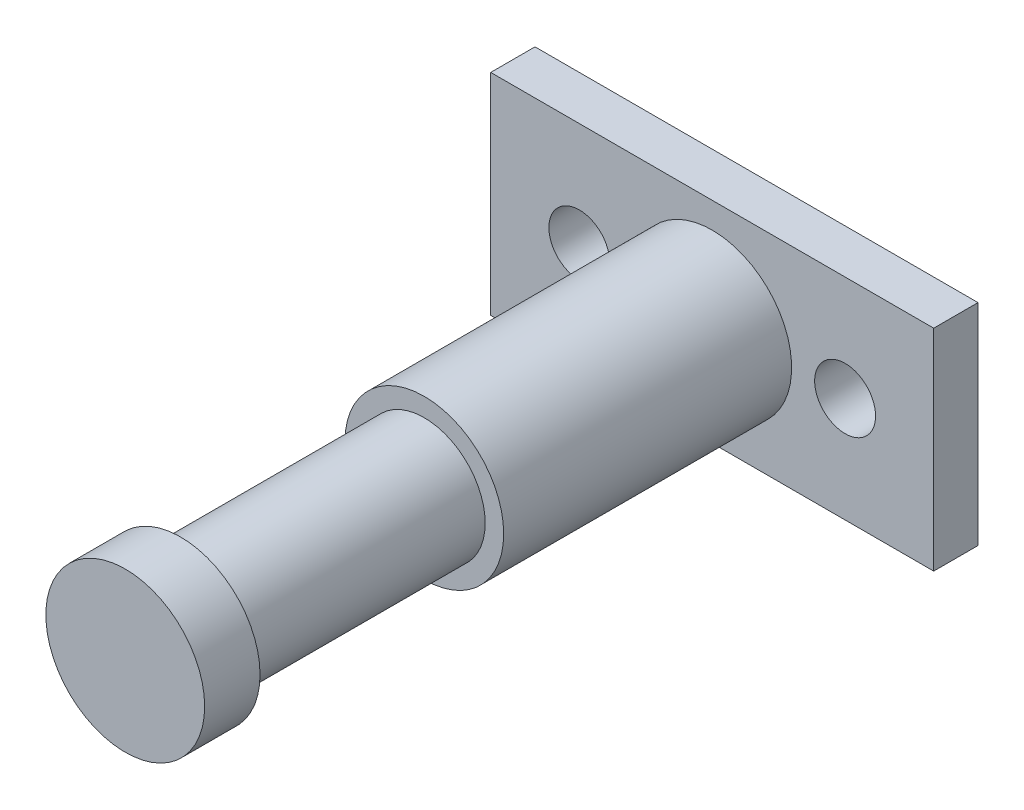
ISO-10303-21;
HEADER;
FILE_DESCRIPTION(('STEP AP214'),'2;1');
FILE_NAME('part.step','',(''),(''),'','','');
FILE_SCHEMA(('AUTOMOTIVE_DESIGN { 1 0 10303 214 1 1 1 1 }'));
ENDSEC;
DATA;
#1=APPLICATION_CONTEXT('core data for automotive mechanical design processes');
#2=APPLICATION_PROTOCOL_DEFINITION('international standard','automotive_design',2000,#1);
#3=PRODUCT_CONTEXT('',#1,'mechanical');
#4=PRODUCT('Part','Part','',(#3));
#5=PRODUCT_RELATED_PRODUCT_CATEGORY('part','',(#4));
#6=PRODUCT_DEFINITION_FORMATION('','',#4);
#7=PRODUCT_DEFINITION_CONTEXT('part definition',#1,'design');
#8=PRODUCT_DEFINITION('design','',#6,#7);
#9=PRODUCT_DEFINITION_SHAPE('','',#8);
#10=(LENGTH_UNIT() NAMED_UNIT(*) SI_UNIT(.MILLI.,.METRE.));
#11=(NAMED_UNIT(*) PLANE_ANGLE_UNIT() SI_UNIT($,.RADIAN.));
#12=(NAMED_UNIT(*) SI_UNIT($,.STERADIAN.) SOLID_ANGLE_UNIT());
#13=UNCERTAINTY_MEASURE_WITH_UNIT(LENGTH_MEASURE(1.E-05),#10,'distance_accuracy_value','');
#14=(GEOMETRIC_REPRESENTATION_CONTEXT(3) GLOBAL_UNCERTAINTY_ASSIGNED_CONTEXT((#13)) GLOBAL_UNIT_ASSIGNED_CONTEXT((#10,
#11,#12)) REPRESENTATION_CONTEXT('',''));
#15=CARTESIAN_POINT('',(0.,0.,0.));
#16=DIRECTION('',(0.,0.,1.));
#17=DIRECTION('',(1.,0.,0.));
#18=AXIS2_PLACEMENT_3D('',#15,#16,#17);
#19=CARTESIAN_POINT('',(0.,0.,26.));
#20=DIRECTION('',(0.,0.,1.));
#21=DIRECTION('',(1.,0.,0.));
#22=AXIS2_PLACEMENT_3D('',#19,#20,#21);
#23=PLANE('',#22);
#24=CARTESIAN_POINT('',(0.,0.,26.));
#25=DIRECTION('',(0.,0.,1.));
#26=DIRECTION('',(1.,0.,0.));
#27=AXIS2_PLACEMENT_3D('',#24,#25,#26);
#28=CIRCLE('',#27,7.1705);
#29=CARTESIAN_POINT('',(7.1705,0.,26.));
#30=VERTEX_POINT('',#29);
#31=EDGE_CURVE('E165',#30,#30,#28,.T.);
#32=ORIENTED_EDGE('',*,*,#31,.T.);
#33=EDGE_LOOP('',(#32));
#34=FACE_BOUND('',#33,.T.);
#35=CARTESIAN_POINT('',(0.,0.,26.));
#36=DIRECTION('',(0.,0.,1.));
#37=DIRECTION('',(1.,0.,0.));
#38=AXIS2_PLACEMENT_3D('',#35,#36,#37);
#39=CIRCLE('',#38,5.5);
#40=CARTESIAN_POINT('',(5.5,0.,26.));
#41=VERTEX_POINT('',#40);
#42=EDGE_CURVE('E169',#41,#41,#39,.T.);
#43=ORIENTED_EDGE('',*,*,#42,.F.);
#44=EDGE_LOOP('',(#43));
#45=FACE_BOUND('',#44,.T.);
#46=ADVANCED_FACE('F33',(#34,#45),#23,.T.);
#47=CARTESIAN_POINT('',(0.,0.,0.));
#48=DIRECTION('',(0.,0.,-1.));
#49=DIRECTION('',(-1.,0.,0.));
#50=AXIS2_PLACEMENT_3D('',#47,#48,#49);
#51=PLANE('',#50);
#52=DIRECTION('',(0.,1.,0.));
#53=VECTOR('',#52,1.);
#54=CARTESIAN_POINT('',(20.,-9.5,0.));
#55=LINE('',#54,#53);
#56=CARTESIAN_POINT('',(20.,-9.5,0.));
#57=VERTEX_POINT('',#56);
#58=CARTESIAN_POINT('',(20.,9.5,0.));
#59=VERTEX_POINT('',#58);
#60=EDGE_CURVE('E101',#57,#59,#55,.T.);
#61=ORIENTED_EDGE('',*,*,#60,.T.);
#62=DIRECTION('',(-1.,0.,0.));
#63=VECTOR('',#62,1.);
#64=CARTESIAN_POINT('',(-20.,9.5,0.));
#65=LINE('',#64,#63);
#66=CARTESIAN_POINT('',(-20.,9.5,0.));
#67=VERTEX_POINT('',#66);
#68=EDGE_CURVE('E104',#59,#67,#65,.T.);
#69=ORIENTED_EDGE('',*,*,#68,.T.);
#70=DIRECTION('',(0.,-1.,0.));
#71=VECTOR('',#70,1.);
#72=CARTESIAN_POINT('',(-20.,-9.5,0.));
#73=LINE('',#72,#71);
#74=CARTESIAN_POINT('',(-20.,-9.5,0.));
#75=VERTEX_POINT('',#74);
#76=EDGE_CURVE('E85',#67,#75,#73,.T.);
#77=ORIENTED_EDGE('',*,*,#76,.T.);
#78=DIRECTION('',(1.,0.,0.));
#79=VECTOR('',#78,1.);
#80=CARTESIAN_POINT('',(-20.,-9.5,0.));
#81=LINE('',#80,#79);
#82=EDGE_CURVE('E96',#75,#57,#81,.T.);
#83=ORIENTED_EDGE('',*,*,#82,.T.);
#84=EDGE_LOOP('',(#61,#69,#77,#83));
#85=FACE_BOUND('',#84,.T.);
#86=CARTESIAN_POINT('',(12.,0.,0.));
#87=DIRECTION('',(0.,0.,1.));
#88=DIRECTION('',(1.,0.,0.));
#89=AXIS2_PLACEMENT_3D('',#86,#87,#88);
#90=CIRCLE('',#89,2.75);
#91=CARTESIAN_POINT('',(14.75,0.,0.));
#92=VERTEX_POINT('',#91);
#93=EDGE_CURVE('E158',#92,#92,#90,.T.);
#94=ORIENTED_EDGE('',*,*,#93,.F.);
#95=EDGE_LOOP('',(#94));
#96=FACE_BOUND('',#95,.T.);
#97=CARTESIAN_POINT('',(-12.,0.,0.));
#98=DIRECTION('',(0.,0.,1.));
#99=DIRECTION('',(1.,0.,0.));
#100=AXIS2_PLACEMENT_3D('',#97,#98,#99);
#101=CIRCLE('',#100,2.75);
#102=CARTESIAN_POINT('',(-9.25,0.,0.));
#103=VERTEX_POINT('',#102);
#104=EDGE_CURVE('E162',#103,#103,#101,.T.);
#105=ORIENTED_EDGE('',*,*,#104,.F.);
#106=EDGE_LOOP('',(#105));
#107=FACE_BOUND('',#106,.T.);
#108=CARTESIAN_POINT('',(0.,0.,0.));
#109=DIRECTION('',(0.,0.,-1.));
#110=DIRECTION('',(-1.,0.,0.));
#111=AXIS2_PLACEMENT_3D('',#108,#109,#110);
#112=CIRCLE('',#111,7.1705);
#113=CARTESIAN_POINT('',(-7.1705,0.,0.));
#114=VERTEX_POINT('',#113);
#115=EDGE_CURVE('E11',#114,#114,#112,.F.);
#116=ORIENTED_EDGE('',*,*,#115,.F.);
#117=EDGE_LOOP('',(#116));
#118=FACE_BOUND('',#117,.T.);
#119=ADVANCED_FACE('F112',(#85,#96,#107,#118),#51,.F.);
#120=CARTESIAN_POINT('',(20.,-9.5,-4.));
#121=DIRECTION('',(1.,0.,0.));
#122=DIRECTION('',(0.,0.,-1.));
#123=AXIS2_PLACEMENT_3D('',#120,#121,#122);
#124=PLANE('',#123);
#125=ORIENTED_EDGE('',*,*,#60,.F.);
#126=DIRECTION('',(0.,0.,1.));
#127=VECTOR('',#126,1.);
#128=CARTESIAN_POINT('',(20.,-9.5,-4.));
#129=LINE('',#128,#127);
#130=CARTESIAN_POINT('',(20.,-9.5,-4.));
#131=VERTEX_POINT('',#130);
#132=EDGE_CURVE('E42',#131,#57,#129,.T.);
#133=ORIENTED_EDGE('',*,*,#132,.F.);
#134=DIRECTION('',(0.,1.,0.));
#135=VECTOR('',#134,1.);
#136=CARTESIAN_POINT('',(20.,-9.5,-4.));
#137=LINE('',#136,#135);
#138=CARTESIAN_POINT('',(20.,9.5,-4.));
#139=VERTEX_POINT('',#138);
#140=EDGE_CURVE('E94',#131,#139,#137,.T.);
#141=ORIENTED_EDGE('',*,*,#140,.T.);
#142=DIRECTION('',(0.,0.,1.));
#143=VECTOR('',#142,1.);
#144=CARTESIAN_POINT('',(20.,9.5,-4.));
#145=LINE('',#144,#143);
#146=EDGE_CURVE('E77',#139,#59,#145,.T.);
#147=ORIENTED_EDGE('',*,*,#146,.T.);
#148=EDGE_LOOP('',(#125,#133,#141,#147));
#149=FACE_BOUND('',#148,.T.);
#150=ADVANCED_FACE('F35',(#149),#124,.T.);
#151=CARTESIAN_POINT('',(-20.,-9.5,-4.));
#152=DIRECTION('',(0.,-1.,0.));
#153=DIRECTION('',(0.,0.,-1.));
#154=AXIS2_PLACEMENT_3D('',#151,#152,#153);
#155=PLANE('',#154);
#156=ORIENTED_EDGE('',*,*,#82,.F.);
#157=DIRECTION('',(0.,0.,1.));
#158=VECTOR('',#157,1.);
#159=CARTESIAN_POINT('',(-20.,-9.5,-4.));
#160=LINE('',#159,#158);
#161=CARTESIAN_POINT('',(-20.,-9.5,-4.));
#162=VERTEX_POINT('',#161);
#163=EDGE_CURVE('E66',#162,#75,#160,.T.);
#164=ORIENTED_EDGE('',*,*,#163,.F.);
#165=DIRECTION('',(1.,0.,0.));
#166=VECTOR('',#165,1.);
#167=CARTESIAN_POINT('',(-20.,-9.5,-4.));
#168=LINE('',#167,#166);
#169=EDGE_CURVE('E91',#162,#131,#168,.T.);
#170=ORIENTED_EDGE('',*,*,#169,.T.);
#171=ORIENTED_EDGE('',*,*,#132,.T.);
#172=EDGE_LOOP('',(#156,#164,#170,#171));
#173=FACE_BOUND('',#172,.T.);
#174=ADVANCED_FACE('F114',(#173),#155,.T.);
#175=CARTESIAN_POINT('',(-20.,-9.5,-4.));
#176=DIRECTION('',(-1.,0.,0.));
#177=DIRECTION('',(0.,0.,1.));
#178=AXIS2_PLACEMENT_3D('',#175,#176,#177);
#179=PLANE('',#178);
#180=ORIENTED_EDGE('',*,*,#76,.F.);
#181=DIRECTION('',(0.,0.,1.));
#182=VECTOR('',#181,1.);
#183=CARTESIAN_POINT('',(-20.,9.5,-4.));
#184=LINE('',#183,#182);
#185=CARTESIAN_POINT('',(-20.,9.5,-4.));
#186=VERTEX_POINT('',#185);
#187=EDGE_CURVE('E80',#186,#67,#184,.T.);
#188=ORIENTED_EDGE('',*,*,#187,.F.);
#189=DIRECTION('',(0.,-1.,0.));
#190=VECTOR('',#189,1.);
#191=CARTESIAN_POINT('',(-20.,-9.5,-4.));
#192=LINE('',#191,#190);
#193=EDGE_CURVE('E83',#186,#162,#192,.T.);
#194=ORIENTED_EDGE('',*,*,#193,.T.);
#195=ORIENTED_EDGE('',*,*,#163,.T.);
#196=EDGE_LOOP('',(#180,#188,#194,#195));
#197=FACE_BOUND('',#196,.T.);
#198=ADVANCED_FACE('F82',(#197),#179,.T.);
#199=CARTESIAN_POINT('',(-20.,9.5,-4.));
#200=DIRECTION('',(0.,1.,0.));
#201=DIRECTION('',(0.,0.,1.));
#202=AXIS2_PLACEMENT_3D('',#199,#200,#201);
#203=PLANE('',#202);
#204=ORIENTED_EDGE('',*,*,#68,.F.);
#205=ORIENTED_EDGE('',*,*,#146,.F.);
#206=DIRECTION('',(-1.,0.,0.));
#207=VECTOR('',#206,1.);
#208=CARTESIAN_POINT('',(-20.,9.5,-4.));
#209=LINE('',#208,#207);
#210=EDGE_CURVE('E90',#139,#186,#209,.T.);
#211=ORIENTED_EDGE('',*,*,#210,.T.);
#212=ORIENTED_EDGE('',*,*,#187,.T.);
#213=EDGE_LOOP('',(#204,#205,#211,#212));
#214=FACE_BOUND('',#213,.T.);
#215=ADVANCED_FACE('F93',(#214),#203,.T.);
#216=CARTESIAN_POINT('',(0.,0.,-4.));
#217=DIRECTION('',(0.,0.,-1.));
#218=DIRECTION('',(-1.,0.,0.));
#219=AXIS2_PLACEMENT_3D('',#216,#217,#218);
#220=PLANE('',#219);
#221=CARTESIAN_POINT('',(-12.,0.,-4.));
#222=DIRECTION('',(0.,0.,1.));
#223=DIRECTION('',(1.,0.,0.));
#224=AXIS2_PLACEMENT_3D('',#221,#222,#223);
#225=CIRCLE('',#224,2.75);
#226=CARTESIAN_POINT('',(-9.25,0.,-4.));
#227=VERTEX_POINT('',#226);
#228=EDGE_CURVE('E155',#227,#227,#225,.T.);
#229=ORIENTED_EDGE('',*,*,#228,.T.);
#230=EDGE_LOOP('',(#229));
#231=FACE_BOUND('',#230,.T.);
#232=CARTESIAN_POINT('',(12.,0.,-4.));
#233=DIRECTION('',(0.,0.,1.));
#234=DIRECTION('',(1.,0.,0.));
#235=AXIS2_PLACEMENT_3D('',#232,#233,#234);
#236=CIRCLE('',#235,2.75);
#237=CARTESIAN_POINT('',(14.75,0.,-4.));
#238=VERTEX_POINT('',#237);
#239=EDGE_CURVE('E105',#238,#238,#236,.T.);
#240=ORIENTED_EDGE('',*,*,#239,.T.);
#241=EDGE_LOOP('',(#240));
#242=FACE_BOUND('',#241,.T.);
#243=ORIENTED_EDGE('',*,*,#140,.F.);
#244=ORIENTED_EDGE('',*,*,#169,.F.);
#245=ORIENTED_EDGE('',*,*,#193,.F.);
#246=ORIENTED_EDGE('',*,*,#210,.F.);
#247=EDGE_LOOP('',(#243,#244,#245,#246));
#248=FACE_BOUND('',#247,.T.);
#249=ADVANCED_FACE('F89',(#231,#242,#248),#220,.T.);
#250=CARTESIAN_POINT('',(12.,0.,-4.));
#251=DIRECTION('',(0.,0.,1.));
#252=DIRECTION('',(1.,0.,0.));
#253=AXIS2_PLACEMENT_3D('',#250,#251,#252);
#254=CYLINDRICAL_SURFACE('',#253,2.75);
#255=ORIENTED_EDGE('',*,*,#239,.F.);
#256=EDGE_LOOP('',(#255));
#257=FACE_BOUND('',#256,.T.);
#258=ORIENTED_EDGE('',*,*,#93,.T.);
#259=EDGE_LOOP('',(#258));
#260=FACE_BOUND('',#259,.T.);
#261=ADVANCED_FACE('F142',(#257,#260),#254,.F.);
#262=CARTESIAN_POINT('',(-12.,0.,-4.));
#263=DIRECTION('',(0.,0.,1.));
#264=DIRECTION('',(1.,0.,0.));
#265=AXIS2_PLACEMENT_3D('',#262,#263,#264);
#266=CYLINDRICAL_SURFACE('',#265,2.75);
#267=ORIENTED_EDGE('',*,*,#228,.F.);
#268=EDGE_LOOP('',(#267));
#269=FACE_BOUND('',#268,.T.);
#270=ORIENTED_EDGE('',*,*,#104,.T.);
#271=EDGE_LOOP('',(#270));
#272=FACE_BOUND('',#271,.T.);
#273=ADVANCED_FACE('F138',(#269,#272),#266,.F.);
#274=CARTESIAN_POINT('',(0.,0.,26.));
#275=DIRECTION('',(0.,0.,-1.));
#276=DIRECTION('',(-1.,0.,0.));
#277=AXIS2_PLACEMENT_3D('',#274,#275,#276);
#278=CYLINDRICAL_SURFACE('',#277,7.1705);
#279=ORIENTED_EDGE('',*,*,#31,.F.);
#280=EDGE_LOOP('',(#279));
#281=FACE_BOUND('',#280,.T.);
#282=ORIENTED_EDGE('',*,*,#115,.T.);
#283=EDGE_LOOP('',(#282));
#284=FACE_BOUND('',#283,.T.);
#285=ADVANCED_FACE('F135',(#281,#284),#278,.T.);
#286=CARTESIAN_POINT('',(0.,0.,48.));
#287=DIRECTION('',(0.,0.,-1.));
#288=DIRECTION('',(-1.,0.,0.));
#289=AXIS2_PLACEMENT_3D('',#286,#287,#288);
#290=CYLINDRICAL_SURFACE('',#289,5.5);
#291=CARTESIAN_POINT('',(0.,0.,48.));
#292=DIRECTION('',(0.,0.,1.));
#293=DIRECTION('',(1.,0.,0.));
#294=AXIS2_PLACEMENT_3D('',#291,#292,#293);
#295=CIRCLE('',#294,5.5);
#296=CARTESIAN_POINT('',(5.5,0.,48.));
#297=VERTEX_POINT('',#296);
#298=EDGE_CURVE('E168',#297,#297,#295,.T.);
#299=ORIENTED_EDGE('',*,*,#298,.F.);
#300=EDGE_LOOP('',(#299));
#301=FACE_BOUND('',#300,.T.);
#302=ORIENTED_EDGE('',*,*,#42,.T.);
#303=EDGE_LOOP('',(#302));
#304=FACE_BOUND('',#303,.T.);
#305=ADVANCED_FACE('F133',(#301,#304),#290,.T.);
#306=CARTESIAN_POINT('',(0.,0.,48.));
#307=DIRECTION('',(0.,0.,1.));
#308=DIRECTION('',(1.,0.,0.));
#309=AXIS2_PLACEMENT_3D('',#306,#307,#308);
#310=PLANE('',#309);
#311=CARTESIAN_POINT('',(0.,0.,48.));
#312=DIRECTION('',(0.,0.,1.));
#313=DIRECTION('',(1.,0.,0.));
#314=AXIS2_PLACEMENT_3D('',#311,#312,#313);
#315=CIRCLE('',#314,7.1705);
#316=CARTESIAN_POINT('',(7.1705,0.,48.));
#317=VERTEX_POINT('',#316);
#318=EDGE_CURVE('E175',#317,#317,#315,.T.);
#319=ORIENTED_EDGE('',*,*,#318,.F.);
#320=EDGE_LOOP('',(#319));
#321=FACE_BOUND('',#320,.T.);
#322=ORIENTED_EDGE('',*,*,#298,.T.);
#323=EDGE_LOOP('',(#322));
#324=FACE_BOUND('',#323,.T.);
#325=ADVANCED_FACE('F186',(#321,#324),#310,.F.);
#326=CARTESIAN_POINT('',(0.,0.,53.));
#327=DIRECTION('',(0.,0.,-1.));
#328=DIRECTION('',(-1.,0.,0.));
#329=AXIS2_PLACEMENT_3D('',#326,#327,#328);
#330=CYLINDRICAL_SURFACE('',#329,7.1705);
#331=CARTESIAN_POINT('',(0.,0.,53.));
#332=DIRECTION('',(0.,0.,1.));
#333=DIRECTION('',(1.,0.,0.));
#334=AXIS2_PLACEMENT_3D('',#331,#332,#333);
#335=CIRCLE('',#334,7.1705);
#336=CARTESIAN_POINT('',(7.1705,0.,53.));
#337=VERTEX_POINT('',#336);
#338=EDGE_CURVE('E172',#337,#337,#335,.T.);
#339=ORIENTED_EDGE('',*,*,#338,.F.);
#340=EDGE_LOOP('',(#339));
#341=FACE_BOUND('',#340,.T.);
#342=ORIENTED_EDGE('',*,*,#318,.T.);
#343=EDGE_LOOP('',(#342));
#344=FACE_BOUND('',#343,.T.);
#345=ADVANCED_FACE('F183',(#341,#344),#330,.T.);
#346=CARTESIAN_POINT('',(0.,0.,53.));
#347=DIRECTION('',(0.,0.,1.));
#348=DIRECTION('',(1.,0.,0.));
#349=AXIS2_PLACEMENT_3D('',#346,#347,#348);
#350=PLANE('',#349);
#351=ORIENTED_EDGE('',*,*,#338,.T.);
#352=EDGE_LOOP('',(#351));
#353=FACE_BOUND('',#352,.T.);
#354=ADVANCED_FACE('F181',(#353),#350,.T.);
#355=CLOSED_SHELL('',(#46,#119,#150,#174,#198,#215,#249,#261,#273,#285,#305,#325,#345,#354));
#356=MANIFOLD_SOLID_BREP('B2',#355);
#357=ADVANCED_BREP_SHAPE_REPRESENTATION('',(#18,#356),#14);
#358=SHAPE_DEFINITION_REPRESENTATION(#9,#357);
ENDSEC;
END-ISO-10303-21;
